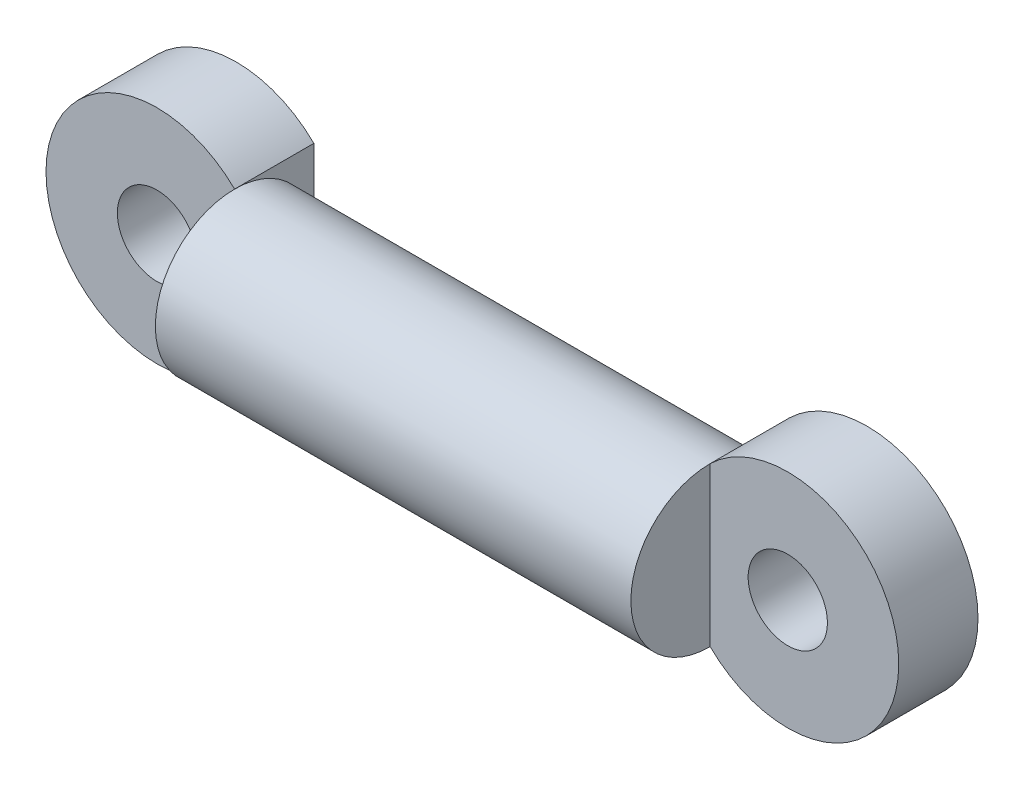
ISO-10303-21;
HEADER;
FILE_DESCRIPTION(('STEP AP214'),'2;1');
FILE_NAME('part.step','',(''),(''),'','','');
FILE_SCHEMA(('AUTOMOTIVE_DESIGN { 1 0 10303 214 1 1 1 1 }'));
ENDSEC;
DATA;
#1=APPLICATION_CONTEXT('core data for automotive mechanical design processes');
#2=APPLICATION_PROTOCOL_DEFINITION('international standard','automotive_design',2000,#1);
#3=PRODUCT_CONTEXT('',#1,'mechanical');
#4=PRODUCT('Part','Part','',(#3));
#5=PRODUCT_RELATED_PRODUCT_CATEGORY('part','',(#4));
#6=PRODUCT_DEFINITION_FORMATION('','',#4);
#7=PRODUCT_DEFINITION_CONTEXT('part definition',#1,'design');
#8=PRODUCT_DEFINITION('design','',#6,#7);
#9=PRODUCT_DEFINITION_SHAPE('','',#8);
#10=(LENGTH_UNIT() NAMED_UNIT(*) SI_UNIT(.MILLI.,.METRE.));
#11=(NAMED_UNIT(*) PLANE_ANGLE_UNIT() SI_UNIT($,.RADIAN.));
#12=(NAMED_UNIT(*) SI_UNIT($,.STERADIAN.) SOLID_ANGLE_UNIT());
#13=UNCERTAINTY_MEASURE_WITH_UNIT(LENGTH_MEASURE(1.E-05),#10,'distance_accuracy_value','');
#14=(GEOMETRIC_REPRESENTATION_CONTEXT(3) GLOBAL_UNCERTAINTY_ASSIGNED_CONTEXT((#13)) GLOBAL_UNIT_ASSIGNED_CONTEXT((#10,
#11,#12)) REPRESENTATION_CONTEXT('',''));
#15=CARTESIAN_POINT('',(0.,0.,0.));
#16=DIRECTION('',(0.,0.,1.));
#17=DIRECTION('',(1.,0.,0.));
#18=AXIS2_PLACEMENT_3D('',#15,#16,#17);
#19=CARTESIAN_POINT('',(15.,0.,0.));
#20=DIRECTION('',(-1.,0.,0.));
#21=DIRECTION('',(0.,-1.,0.));
#22=AXIS2_PLACEMENT_3D('',#19,#20,#21);
#23=PLANE('',#22);
#24=DIRECTION('',(0.,-1.,0.));
#25=VECTOR('',#24,1.);
#26=CARTESIAN_POINT('',(15.,5.00000000000001,0.));
#27=LINE('',#26,#25);
#28=CARTESIAN_POINT('',(15.,5.00000000000001,0.));
#29=VERTEX_POINT('',#28);
#30=CARTESIAN_POINT('',(15.,-4.99999999999999,0.));
#31=VERTEX_POINT('',#30);
#32=EDGE_CURVE('E272',#29,#31,#27,.T.);
#33=ORIENTED_EDGE('',*,*,#32,.F.);
#34=CARTESIAN_POINT('',(15.,0.,0.));
#35=DIRECTION('',(-1.,0.,0.));
#36=DIRECTION('',(0.,-1.,0.));
#37=AXIS2_PLACEMENT_3D('',#34,#35,#36);
#38=CIRCLE('',#37,5.);
#39=EDGE_CURVE('E286',#31,#29,#38,.T.);
#40=ORIENTED_EDGE('',*,*,#39,.F.);
#41=EDGE_LOOP('',(#33,#40));
#42=FACE_BOUND('',#41,.T.);
#43=ADVANCED_FACE('F39',(#42),#23,.F.);
#44=CARTESIAN_POINT('',(-15.,0.,0.));
#45=DIRECTION('',(-1.,0.,0.));
#46=DIRECTION('',(0.,-1.,0.));
#47=AXIS2_PLACEMENT_3D('',#44,#45,#46);
#48=CYLINDRICAL_SURFACE('',#47,5.);
#49=ORIENTED_EDGE('',*,*,#39,.T.);
#50=CARTESIAN_POINT('',(15.,0.,-5.));
#51=VERTEX_POINT('',#50);
#52=EDGE_CURVE('E62',#29,#51,#38,.T.);
#53=ORIENTED_EDGE('',*,*,#52,.T.);
#54=EDGE_CURVE('E284',#51,#31,#38,.T.);
#55=ORIENTED_EDGE('',*,*,#54,.T.);
#56=EDGE_LOOP('',(#49,#53,#55));
#57=FACE_BOUND('',#56,.T.);
#58=CARTESIAN_POINT('',(-15.,0.,0.));
#59=DIRECTION('',(-1.,0.,0.));
#60=DIRECTION('',(0.,-1.,0.));
#61=AXIS2_PLACEMENT_3D('',#58,#59,#60);
#62=CIRCLE('',#61,5.);
#63=CARTESIAN_POINT('',(-15.,-5.,0.));
#64=VERTEX_POINT('',#63);
#65=CARTESIAN_POINT('',(-15.,5.,0.));
#66=VERTEX_POINT('',#65);
#67=EDGE_CURVE('E11',#64,#66,#62,.T.);
#68=ORIENTED_EDGE('',*,*,#67,.F.);
#69=CARTESIAN_POINT('',(-15.,0.,-5.));
#70=VERTEX_POINT('',#69);
#71=EDGE_CURVE('E48',#70,#64,#62,.T.);
#72=ORIENTED_EDGE('',*,*,#71,.F.);
#73=EDGE_CURVE('E47',#66,#70,#62,.T.);
#74=ORIENTED_EDGE('',*,*,#73,.F.);
#75=EDGE_LOOP('',(#68,#72,#74));
#76=FACE_BOUND('',#75,.T.);
#77=ADVANCED_FACE('F41',(#57,#76),#48,.T.);
#78=CARTESIAN_POINT('',(-15.,-5.,0.));
#79=DIRECTION('',(1.,0.,0.));
#80=DIRECTION('',(0.,1.,0.));
#81=AXIS2_PLACEMENT_3D('',#78,#79,#80);
#82=PLANE('',#81);
#83=ORIENTED_EDGE('',*,*,#67,.T.);
#84=DIRECTION('',(0.,1.,0.));
#85=VECTOR('',#84,1.);
#86=CARTESIAN_POINT('',(-15.,-5.,0.));
#87=LINE('',#86,#85);
#88=EDGE_CURVE('E102',#64,#66,#87,.T.);
#89=ORIENTED_EDGE('',*,*,#88,.F.);
#90=EDGE_LOOP('',(#83,#89));
#91=FACE_BOUND('',#90,.T.);
#92=ADVANCED_FACE('F112',(#91),#82,.F.);
#93=CARTESIAN_POINT('',(15.,5.00000000000001,-5.));
#94=DIRECTION('',(-1.,0.,0.));
#95=DIRECTION('',(0.,-1.,0.));
#96=AXIS2_PLACEMENT_3D('',#93,#94,#95);
#97=PLANE('',#96);
#98=DIRECTION('',(0.,0.,1.));
#99=VECTOR('',#98,1.);
#100=CARTESIAN_POINT('',(15.,-4.99999999999999,-5.));
#101=LINE('',#100,#99);
#102=CARTESIAN_POINT('',(15.,-4.99999999999999,-5.));
#103=VERTEX_POINT('',#102);
#104=EDGE_CURVE('E281',#103,#31,#101,.T.);
#105=ORIENTED_EDGE('',*,*,#104,.T.);
#106=ORIENTED_EDGE('',*,*,#54,.F.);
#107=DIRECTION('',(0.,-1.,0.));
#108=VECTOR('',#107,1.);
#109=CARTESIAN_POINT('',(15.,5.00000000000001,-5.));
#110=LINE('',#109,#108);
#111=EDGE_CURVE('E271',#51,#103,#110,.T.);
#112=ORIENTED_EDGE('',*,*,#111,.T.);
#113=EDGE_LOOP('',(#105,#106,#112));
#114=FACE_BOUND('',#113,.T.);
#115=ADVANCED_FACE('F114',(#114),#97,.T.);
#116=CARTESIAN_POINT('',(19.8989794855664,0.,-5.));
#117=DIRECTION('',(0.,0.,1.));
#118=DIRECTION('',(1.,0.,0.));
#119=AXIS2_PLACEMENT_3D('',#116,#117,#118);
#120=CYLINDRICAL_SURFACE('',#119,7.);
#121=CARTESIAN_POINT('',(19.8989794855664,0.,0.));
#122=DIRECTION('',(0.,0.,1.));
#123=DIRECTION('',(-1.,0.,0.));
#124=AXIS2_PLACEMENT_3D('',#121,#122,#123);
#125=CIRCLE('',#124,7.);
#126=EDGE_CURVE('E265',#31,#29,#125,.T.);
#127=ORIENTED_EDGE('',*,*,#126,.F.);
#128=ORIENTED_EDGE('',*,*,#104,.F.);
#129=CARTESIAN_POINT('',(19.8989794855664,0.,-5.));
#130=DIRECTION('',(0.,0.,1.));
#131=DIRECTION('',(-1.,0.,0.));
#132=AXIS2_PLACEMENT_3D('',#129,#130,#131);
#133=CIRCLE('',#132,7.);
#134=CARTESIAN_POINT('',(15.,5.00000000000001,-5.));
#135=VERTEX_POINT('',#134);
#136=EDGE_CURVE('E268',#103,#135,#133,.T.);
#137=ORIENTED_EDGE('',*,*,#136,.T.);
#138=DIRECTION('',(0.,0.,1.));
#139=VECTOR('',#138,1.);
#140=CARTESIAN_POINT('',(15.,5.00000000000001,-5.));
#141=LINE('',#140,#139);
#142=EDGE_CURVE('E276',#135,#29,#141,.T.);
#143=ORIENTED_EDGE('',*,*,#142,.T.);
#144=EDGE_LOOP('',(#127,#128,#137,#143));
#145=FACE_BOUND('',#144,.T.);
#146=ADVANCED_FACE('F119',(#145),#120,.T.);
#147=EDGE_CURVE('E273',#135,#51,#110,.T.);
#148=ORIENTED_EDGE('',*,*,#147,.T.);
#149=ORIENTED_EDGE('',*,*,#52,.F.);
#150=ORIENTED_EDGE('',*,*,#142,.F.);
#151=EDGE_LOOP('',(#148,#149,#150));
#152=FACE_BOUND('',#151,.T.);
#153=ADVANCED_FACE('F122',(#152),#97,.T.);
#154=CARTESIAN_POINT('',(19.8989794855664,0.,-5.));
#155=DIRECTION('',(0.,0.,-1.));
#156=DIRECTION('',(-1.,0.,0.));
#157=AXIS2_PLACEMENT_3D('',#154,#155,#156);
#158=PLANE('',#157);
#159=CARTESIAN_POINT('',(19.8989794855664,0.,-5.));
#160=DIRECTION('',(0.,0.,1.));
#161=DIRECTION('',(1.,0.,0.));
#162=AXIS2_PLACEMENT_3D('',#159,#160,#161);
#163=CIRCLE('',#162,2.5);
#164=CARTESIAN_POINT('',(22.3989794855664,0.,-5.));
#165=VERTEX_POINT('',#164);
#166=EDGE_CURVE('E262',#165,#165,#163,.T.);
#167=ORIENTED_EDGE('',*,*,#166,.T.);
#168=EDGE_LOOP('',(#167));
#169=FACE_BOUND('',#168,.T.);
#170=ORIENTED_EDGE('',*,*,#136,.F.);
#171=ORIENTED_EDGE('',*,*,#111,.F.);
#172=ORIENTED_EDGE('',*,*,#147,.F.);
#173=EDGE_LOOP('',(#170,#171,#172));
#174=FACE_BOUND('',#173,.T.);
#175=ADVANCED_FACE('F133',(#169,#174),#158,.T.);
#176=CARTESIAN_POINT('',(19.8989794855664,0.,0.));
#177=DIRECTION('',(0.,0.,-1.));
#178=DIRECTION('',(-1.,0.,0.));
#179=AXIS2_PLACEMENT_3D('',#176,#177,#178);
#180=PLANE('',#179);
#181=CARTESIAN_POINT('',(19.8989794855664,0.,0.));
#182=DIRECTION('',(0.,0.,1.));
#183=DIRECTION('',(1.,0.,0.));
#184=AXIS2_PLACEMENT_3D('',#181,#182,#183);
#185=CIRCLE('',#184,2.5);
#186=CARTESIAN_POINT('',(22.3989794855664,0.,0.));
#187=VERTEX_POINT('',#186);
#188=EDGE_CURVE('E259',#187,#187,#185,.T.);
#189=ORIENTED_EDGE('',*,*,#188,.F.);
#190=EDGE_LOOP('',(#189));
#191=FACE_BOUND('',#190,.T.);
#192=ORIENTED_EDGE('',*,*,#126,.T.);
#193=ORIENTED_EDGE('',*,*,#32,.T.);
#194=EDGE_LOOP('',(#192,#193));
#195=FACE_BOUND('',#194,.T.);
#196=ADVANCED_FACE('F135',(#191,#195),#180,.F.);
#197=CARTESIAN_POINT('',(19.8989794855664,0.,-5.));
#198=DIRECTION('',(0.,0.,1.));
#199=DIRECTION('',(1.,0.,0.));
#200=AXIS2_PLACEMENT_3D('',#197,#198,#199);
#201=CYLINDRICAL_SURFACE('',#200,2.5);
#202=ORIENTED_EDGE('',*,*,#166,.F.);
#203=EDGE_LOOP('',(#202));
#204=FACE_BOUND('',#203,.T.);
#205=ORIENTED_EDGE('',*,*,#188,.T.);
#206=EDGE_LOOP('',(#205));
#207=FACE_BOUND('',#206,.T.);
#208=ADVANCED_FACE('F138',(#204,#207),#201,.F.);
#209=CARTESIAN_POINT('',(-15.,-5.,-5.));
#210=DIRECTION('',(1.,0.,0.));
#211=DIRECTION('',(0.,1.,0.));
#212=AXIS2_PLACEMENT_3D('',#209,#210,#211);
#213=PLANE('',#212);
#214=DIRECTION('',(0.,0.,1.));
#215=VECTOR('',#214,1.);
#216=CARTESIAN_POINT('',(-15.,5.,-5.));
#217=LINE('',#216,#215);
#218=CARTESIAN_POINT('',(-15.,5.,-5.));
#219=VERTEX_POINT('',#218);
#220=EDGE_CURVE('E89',#219,#66,#217,.T.);
#221=ORIENTED_EDGE('',*,*,#220,.T.);
#222=ORIENTED_EDGE('',*,*,#73,.T.);
#223=DIRECTION('',(0.,1.,0.));
#224=VECTOR('',#223,1.);
#225=CARTESIAN_POINT('',(-15.,-5.,-5.));
#226=LINE('',#225,#224);
#227=EDGE_CURVE('E93',#70,#219,#226,.T.);
#228=ORIENTED_EDGE('',*,*,#227,.T.);
#229=EDGE_LOOP('',(#221,#222,#228));
#230=FACE_BOUND('',#229,.T.);
#231=ADVANCED_FACE('F90',(#230),#213,.T.);
#232=CARTESIAN_POINT('',(-19.8989794855664,0.,-5.));
#233=DIRECTION('',(0.,0.,1.));
#234=DIRECTION('',(1.,0.,0.));
#235=AXIS2_PLACEMENT_3D('',#232,#233,#234);
#236=CYLINDRICAL_SURFACE('',#235,7.);
#237=CARTESIAN_POINT('',(-19.8989794855664,0.,0.));
#238=DIRECTION('',(0.,0.,1.));
#239=DIRECTION('',(1.,0.,0.));
#240=AXIS2_PLACEMENT_3D('',#237,#238,#239);
#241=CIRCLE('',#240,7.);
#242=EDGE_CURVE('E54',#66,#64,#241,.T.);
#243=ORIENTED_EDGE('',*,*,#242,.F.);
#244=ORIENTED_EDGE('',*,*,#220,.F.);
#245=CARTESIAN_POINT('',(-19.8989794855664,0.,-5.));
#246=DIRECTION('',(0.,0.,1.));
#247=DIRECTION('',(1.,0.,0.));
#248=AXIS2_PLACEMENT_3D('',#245,#246,#247);
#249=CIRCLE('',#248,7.);
#250=CARTESIAN_POINT('',(-15.,-5.,-5.));
#251=VERTEX_POINT('',#250);
#252=EDGE_CURVE('E108',#219,#251,#249,.T.);
#253=ORIENTED_EDGE('',*,*,#252,.T.);
#254=DIRECTION('',(0.,0.,1.));
#255=VECTOR('',#254,1.);
#256=CARTESIAN_POINT('',(-15.,-5.,-5.));
#257=LINE('',#256,#255);
#258=EDGE_CURVE('E97',#251,#64,#257,.T.);
#259=ORIENTED_EDGE('',*,*,#258,.T.);
#260=EDGE_LOOP('',(#243,#244,#253,#259));
#261=FACE_BOUND('',#260,.T.);
#262=ADVANCED_FACE('F99',(#261),#236,.T.);
#263=EDGE_CURVE('E251',#251,#70,#226,.T.);
#264=ORIENTED_EDGE('',*,*,#263,.T.);
#265=ORIENTED_EDGE('',*,*,#71,.T.);
#266=ORIENTED_EDGE('',*,*,#258,.F.);
#267=EDGE_LOOP('',(#264,#265,#266));
#268=FACE_BOUND('',#267,.T.);
#269=ADVANCED_FACE('F153',(#268),#213,.T.);
#270=CARTESIAN_POINT('',(-19.8989794855664,0.,-5.));
#271=DIRECTION('',(0.,0.,1.));
#272=DIRECTION('',(1.,0.,0.));
#273=AXIS2_PLACEMENT_3D('',#270,#271,#272);
#274=PLANE('',#273);
#275=CARTESIAN_POINT('',(-19.8989794855664,0.,-5.));
#276=DIRECTION('',(0.,0.,1.));
#277=DIRECTION('',(1.,0.,0.));
#278=AXIS2_PLACEMENT_3D('',#275,#276,#277);
#279=CIRCLE('',#278,2.5);
#280=CARTESIAN_POINT('',(-17.3989794855664,0.,-5.));
#281=VERTEX_POINT('',#280);
#282=EDGE_CURVE('E101',#281,#281,#279,.T.);
#283=ORIENTED_EDGE('',*,*,#282,.T.);
#284=EDGE_LOOP('',(#283));
#285=FACE_BOUND('',#284,.T.);
#286=ORIENTED_EDGE('',*,*,#252,.F.);
#287=ORIENTED_EDGE('',*,*,#227,.F.);
#288=ORIENTED_EDGE('',*,*,#263,.F.);
#289=EDGE_LOOP('',(#286,#287,#288));
#290=FACE_BOUND('',#289,.T.);
#291=ADVANCED_FACE('F150',(#285,#290),#274,.F.);
#292=CARTESIAN_POINT('',(-19.8989794855664,0.,0.));
#293=DIRECTION('',(0.,0.,1.));
#294=DIRECTION('',(1.,0.,0.));
#295=AXIS2_PLACEMENT_3D('',#292,#293,#294);
#296=PLANE('',#295);
#297=CARTESIAN_POINT('',(-19.8989794855664,0.,0.));
#298=DIRECTION('',(0.,0.,1.));
#299=DIRECTION('',(1.,0.,0.));
#300=AXIS2_PLACEMENT_3D('',#297,#298,#299);
#301=CIRCLE('',#300,2.5);
#302=CARTESIAN_POINT('',(-17.3989794855664,0.,0.));
#303=VERTEX_POINT('',#302);
#304=EDGE_CURVE('E256',#303,#303,#301,.T.);
#305=ORIENTED_EDGE('',*,*,#304,.F.);
#306=EDGE_LOOP('',(#305));
#307=FACE_BOUND('',#306,.T.);
#308=ORIENTED_EDGE('',*,*,#242,.T.);
#309=ORIENTED_EDGE('',*,*,#88,.T.);
#310=EDGE_LOOP('',(#308,#309));
#311=FACE_BOUND('',#310,.T.);
#312=ADVANCED_FACE('F105',(#307,#311),#296,.T.);
#313=CARTESIAN_POINT('',(-19.8989794855664,0.,-5.));
#314=DIRECTION('',(0.,0.,1.));
#315=DIRECTION('',(1.,0.,0.));
#316=AXIS2_PLACEMENT_3D('',#313,#314,#315);
#317=CYLINDRICAL_SURFACE('',#316,2.5);
#318=ORIENTED_EDGE('',*,*,#282,.F.);
#319=EDGE_LOOP('',(#318));
#320=FACE_BOUND('',#319,.T.);
#321=ORIENTED_EDGE('',*,*,#304,.T.);
#322=EDGE_LOOP('',(#321));
#323=FACE_BOUND('',#322,.T.);
#324=ADVANCED_FACE('F146',(#320,#323),#317,.F.);
#325=CLOSED_SHELL('',(#43,#77,#92,#115,#146,#153,#175,#196,#208,#231,#262,#269,#291,#312,#324));
#326=MANIFOLD_SOLID_BREP('B2',#325);
#327=ADVANCED_BREP_SHAPE_REPRESENTATION('',(#18,#326),#14);
#328=SHAPE_DEFINITION_REPRESENTATION(#9,#327);
ENDSEC;
END-ISO-10303-21;
